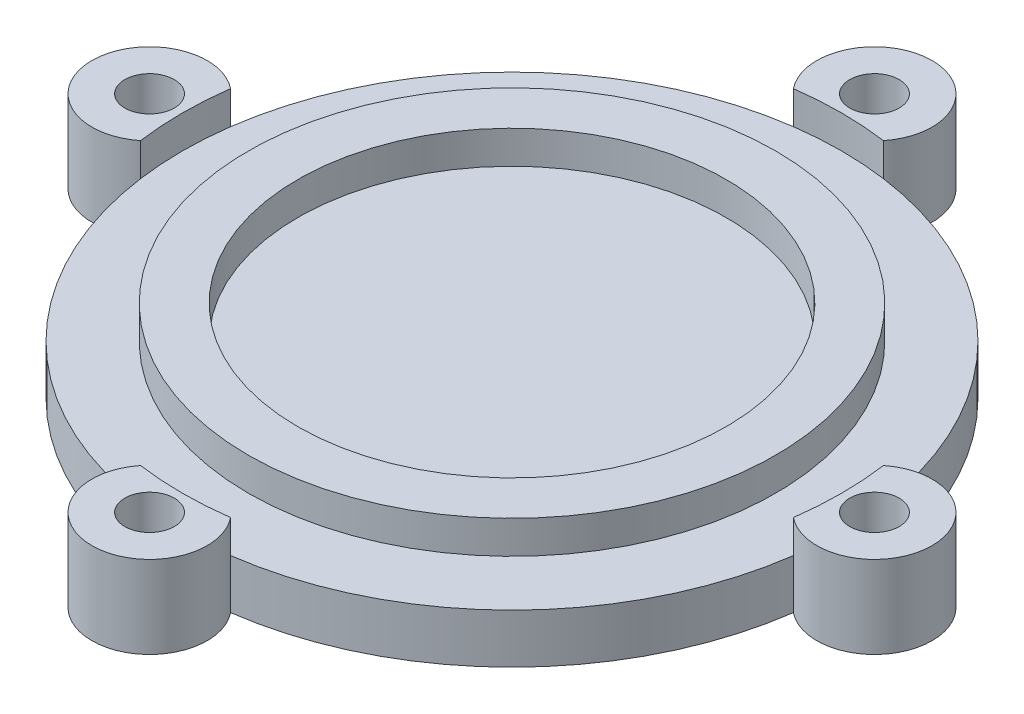
ISO-10303-21;
HEADER;
FILE_DESCRIPTION(('STEP AP214'),'2;1');
FILE_NAME('part.step','',(''),(''),'','','');
FILE_SCHEMA(('AUTOMOTIVE_DESIGN { 1 0 10303 214 1 1 1 1 }'));
ENDSEC;
DATA;
#1=APPLICATION_CONTEXT('core data for automotive mechanical design processes');
#2=APPLICATION_PROTOCOL_DEFINITION('international standard','automotive_design',2000,#1);
#3=PRODUCT_CONTEXT('',#1,'mechanical');
#4=PRODUCT('Part','Part','',(#3));
#5=PRODUCT_RELATED_PRODUCT_CATEGORY('part','',(#4));
#6=PRODUCT_DEFINITION_FORMATION('','',#4);
#7=PRODUCT_DEFINITION_CONTEXT('part definition',#1,'design');
#8=PRODUCT_DEFINITION('design','',#6,#7);
#9=PRODUCT_DEFINITION_SHAPE('','',#8);
#10=(LENGTH_UNIT() NAMED_UNIT(*) SI_UNIT(.MILLI.,.METRE.));
#11=(NAMED_UNIT(*) PLANE_ANGLE_UNIT() SI_UNIT($,.RADIAN.));
#12=(NAMED_UNIT(*) SI_UNIT($,.STERADIAN.) SOLID_ANGLE_UNIT());
#13=UNCERTAINTY_MEASURE_WITH_UNIT(LENGTH_MEASURE(1.E-05),#10,'distance_accuracy_value','');
#14=(GEOMETRIC_REPRESENTATION_CONTEXT(3) GLOBAL_UNCERTAINTY_ASSIGNED_CONTEXT((#13)) GLOBAL_UNIT_ASSIGNED_CONTEXT((#10,
#11,#12)) REPRESENTATION_CONTEXT('',''));
#15=CARTESIAN_POINT('',(0.,0.,0.));
#16=DIRECTION('',(0.,0.,1.));
#17=DIRECTION('',(1.,0.,0.));
#18=AXIS2_PLACEMENT_3D('',#15,#16,#17);
#19=CARTESIAN_POINT('',(0.,3.,0.));
#20=DIRECTION('',(0.,1.,0.));
#21=DIRECTION('',(0.,0.,1.));
#22=AXIS2_PLACEMENT_3D('',#19,#20,#21);
#23=PLANE('',#22);
#24=CARTESIAN_POINT('',(0.,3.,0.));
#25=DIRECTION('',(0.,1.,0.));
#26=DIRECTION('',(0.,0.,1.));
#27=AXIS2_PLACEMENT_3D('',#24,#25,#26);
#28=CIRCLE('',#27,16.);
#29=CARTESIAN_POINT('',(0.,3.,16.));
#30=VERTEX_POINT('',#29);
#31=EDGE_CURVE('E390',#30,#30,#28,.T.);
#32=ORIENTED_EDGE('',*,*,#31,.F.);
#33=EDGE_LOOP('',(#32));
#34=FACE_BOUND('',#33,.T.);
#35=CARTESIAN_POINT('',(0.,3.,0.));
#36=DIRECTION('',(0.,1.,0.));
#37=DIRECTION('',(0.,0.,1.));
#38=AXIS2_PLACEMENT_3D('',#35,#36,#37);
#39=CIRCLE('',#38,20.);
#40=CARTESIAN_POINT('',(-19.8125,3.,-2.73218662429926));
#41=VERTEX_POINT('',#40);
#42=CARTESIAN_POINT('',(-19.8125,3.,2.73218662429921));
#43=VERTEX_POINT('',#42);
#44=EDGE_CURVE('E97',#41,#43,#39,.T.);
#45=ORIENTED_EDGE('',*,*,#44,.T.);
#46=CARTESIAN_POINT('',(0.,3.,0.));
#47=DIRECTION('',(0.,1.,0.));
#48=DIRECTION('',(0.,0.,1.));
#49=AXIS2_PLACEMENT_3D('',#46,#47,#48);
#50=CIRCLE('',#49,20.);
#51=CARTESIAN_POINT('',(-2.73218662429929,3.,19.8125));
#52=VERTEX_POINT('',#51);
#53=EDGE_CURVE('E251',#43,#52,#50,.T.);
#54=ORIENTED_EDGE('',*,*,#53,.T.);
#55=CARTESIAN_POINT('',(0.,3.,0.));
#56=DIRECTION('',(0.,1.,0.));
#57=DIRECTION('',(0.,0.,1.));
#58=AXIS2_PLACEMENT_3D('',#55,#56,#57);
#59=CIRCLE('',#58,20.);
#60=CARTESIAN_POINT('',(2.73218662429922,3.,19.8125));
#61=VERTEX_POINT('',#60);
#62=EDGE_CURVE('E236',#52,#61,#59,.T.);
#63=ORIENTED_EDGE('',*,*,#62,.T.);
#64=CARTESIAN_POINT('',(19.8125,3.,2.73218662429931));
#65=VERTEX_POINT('',#64);
#66=EDGE_CURVE('E246',#61,#65,#50,.T.);
#67=ORIENTED_EDGE('',*,*,#66,.T.);
#68=CARTESIAN_POINT('',(0.,3.,0.));
#69=DIRECTION('',(0.,1.,0.));
#70=DIRECTION('',(0.,0.,1.));
#71=AXIS2_PLACEMENT_3D('',#68,#69,#70);
#72=CIRCLE('',#71,20.);
#73=CARTESIAN_POINT('',(19.8125,3.,-2.73218662429928));
#74=VERTEX_POINT('',#73);
#75=EDGE_CURVE('E220',#65,#74,#72,.T.);
#76=ORIENTED_EDGE('',*,*,#75,.T.);
#77=CARTESIAN_POINT('',(2.73218662429928,3.,-19.8125));
#78=VERTEX_POINT('',#77);
#79=EDGE_CURVE('E249',#74,#78,#50,.T.);
#80=ORIENTED_EDGE('',*,*,#79,.T.);
#81=CARTESIAN_POINT('',(0.,3.,0.));
#82=DIRECTION('',(0.,1.,0.));
#83=DIRECTION('',(0.,0.,1.));
#84=AXIS2_PLACEMENT_3D('',#81,#82,#83);
#85=CIRCLE('',#84,20.);
#86=CARTESIAN_POINT('',(-2.73218662429926,3.,-19.8125));
#87=VERTEX_POINT('',#86);
#88=EDGE_CURVE('E204',#78,#87,#85,.T.);
#89=ORIENTED_EDGE('',*,*,#88,.T.);
#90=EDGE_CURVE('E407',#87,#41,#50,.T.);
#91=ORIENTED_EDGE('',*,*,#90,.T.);
#92=EDGE_LOOP('',(#45,#54,#63,#67,#76,#80,#89,#91));
#93=FACE_BOUND('',#92,.T.);
#94=ADVANCED_FACE('F80',(#34,#93),#23,.T.);
#95=CARTESIAN_POINT('',(0.,3.,22.));
#96=DIRECTION('',(0.,-1.,0.));
#97=DIRECTION('',(0.,0.,-1.));
#98=AXIS2_PLACEMENT_3D('',#95,#96,#97);
#99=CYLINDRICAL_SURFACE('',#98,3.49999999999997);
#100=CARTESIAN_POINT('',(0.,0.,22.));
#101=DIRECTION('',(0.,1.,0.));
#102=DIRECTION('',(0.,0.,1.));
#103=AXIS2_PLACEMENT_3D('',#100,#101,#102);
#104=CIRCLE('',#103,3.49999999999997);
#105=CARTESIAN_POINT('',(2.73218662429922,0.,19.8125));
#106=VERTEX_POINT('',#105);
#107=CARTESIAN_POINT('',(-2.73218662429927,0.,19.8125));
#108=VERTEX_POINT('',#107);
#109=EDGE_CURVE('E254',#106,#108,#104,.F.);
#110=ORIENTED_EDGE('',*,*,#109,.F.);
#111=DIRECTION('',(0.,-1.,0.));
#112=VECTOR('',#111,1.);
#113=CARTESIAN_POINT('',(2.73218662429922,3.,19.8125));
#114=LINE('',#113,#112);
#115=EDGE_CURVE('E89',#61,#106,#114,.T.);
#116=ORIENTED_EDGE('',*,*,#115,.F.);
#117=DIRECTION('',(0.,-1.,0.));
#118=VECTOR('',#117,1.);
#119=CARTESIAN_POINT('',(2.73218662429925,5.,19.8125));
#120=LINE('',#119,#118);
#121=CARTESIAN_POINT('',(2.73218662429925,5.,19.8125));
#122=VERTEX_POINT('',#121);
#123=EDGE_CURVE('E143',#122,#61,#120,.T.);
#124=ORIENTED_EDGE('',*,*,#123,.F.);
#125=CARTESIAN_POINT('',(0.,5.,22.));
#126=DIRECTION('',(0.,1.,0.));
#127=DIRECTION('',(0.,0.,1.));
#128=AXIS2_PLACEMENT_3D('',#125,#126,#127);
#129=CIRCLE('',#128,3.49999999999997);
#130=CARTESIAN_POINT('',(-2.73218662429929,5.,19.8125));
#131=VERTEX_POINT('',#130);
#132=EDGE_CURVE('E237',#131,#122,#129,.T.);
#133=ORIENTED_EDGE('',*,*,#132,.F.);
#134=DIRECTION('',(0.,-1.,0.));
#135=VECTOR('',#134,1.);
#136=CARTESIAN_POINT('',(-2.73218662429929,5.,19.8125));
#137=LINE('',#136,#135);
#138=EDGE_CURVE('E241',#131,#52,#137,.T.);
#139=ORIENTED_EDGE('',*,*,#138,.T.);
#140=DIRECTION('',(0.,-1.,0.));
#141=VECTOR('',#140,1.);
#142=CARTESIAN_POINT('',(-2.73218662429927,3.,19.8125));
#143=LINE('',#142,#141);
#144=EDGE_CURVE('E136',#52,#108,#143,.T.);
#145=ORIENTED_EDGE('',*,*,#144,.T.);
#146=EDGE_LOOP('',(#110,#116,#124,#133,#139,#145));
#147=FACE_BOUND('',#146,.T.);
#148=ADVANCED_FACE('F302',(#147),#99,.T.);
#149=CARTESIAN_POINT('',(0.,3.,0.));
#150=DIRECTION('',(0.,-1.,0.));
#151=DIRECTION('',(0.,0.,-1.));
#152=AXIS2_PLACEMENT_3D('',#149,#150,#151);
#153=CYLINDRICAL_SURFACE('',#152,20.);
#154=CARTESIAN_POINT('',(0.,0.,0.));
#155=DIRECTION('',(0.,1.,0.));
#156=DIRECTION('',(0.,0.,1.));
#157=AXIS2_PLACEMENT_3D('',#154,#155,#156);
#158=CIRCLE('',#157,20.);
#159=CARTESIAN_POINT('',(19.8125,0.,2.73218662429931));
#160=VERTEX_POINT('',#159);
#161=EDGE_CURVE('E257',#106,#160,#158,.T.);
#162=ORIENTED_EDGE('',*,*,#161,.T.);
#163=DIRECTION('',(0.,-1.,0.));
#164=VECTOR('',#163,1.);
#165=CARTESIAN_POINT('',(19.8125,3.,2.73218662429931));
#166=LINE('',#165,#164);
#167=EDGE_CURVE('E290',#65,#160,#166,.T.);
#168=ORIENTED_EDGE('',*,*,#167,.F.);
#169=ORIENTED_EDGE('',*,*,#66,.F.);
#170=ORIENTED_EDGE('',*,*,#115,.T.);
#171=EDGE_LOOP('',(#162,#168,#169,#170));
#172=FACE_BOUND('',#171,.T.);
#173=ADVANCED_FACE('F295',(#172),#153,.T.);
#174=CARTESIAN_POINT('',(22.,3.,0.));
#175=DIRECTION('',(0.,-1.,0.));
#176=DIRECTION('',(0.,0.,-1.));
#177=AXIS2_PLACEMENT_3D('',#174,#175,#176);
#178=CYLINDRICAL_SURFACE('',#177,3.49999999999999);
#179=CARTESIAN_POINT('',(22.,0.,0.));
#180=DIRECTION('',(0.,1.,0.));
#181=DIRECTION('',(0.,0.,1.));
#182=AXIS2_PLACEMENT_3D('',#179,#180,#181);
#183=CIRCLE('',#182,3.49999999999999);
#184=CARTESIAN_POINT('',(19.8125,0.,-2.73218662429928));
#185=VERTEX_POINT('',#184);
#186=EDGE_CURVE('E260',#185,#160,#183,.F.);
#187=ORIENTED_EDGE('',*,*,#186,.F.);
#188=DIRECTION('',(0.,-1.,0.));
#189=VECTOR('',#188,1.);
#190=CARTESIAN_POINT('',(19.8125,3.,-2.73218662429928));
#191=LINE('',#190,#189);
#192=EDGE_CURVE('E288',#74,#185,#191,.T.);
#193=ORIENTED_EDGE('',*,*,#192,.F.);
#194=DIRECTION('',(0.,-1.,0.));
#195=VECTOR('',#194,1.);
#196=CARTESIAN_POINT('',(19.8125,5.,-2.73218662429928));
#197=LINE('',#196,#195);
#198=CARTESIAN_POINT('',(19.8125,5.,-2.73218662429928));
#199=VERTEX_POINT('',#198);
#200=EDGE_CURVE('E231',#199,#74,#197,.T.);
#201=ORIENTED_EDGE('',*,*,#200,.F.);
#202=CARTESIAN_POINT('',(22.,5.,0.));
#203=DIRECTION('',(0.,1.,0.));
#204=DIRECTION('',(0.,0.,1.));
#205=AXIS2_PLACEMENT_3D('',#202,#203,#204);
#206=CIRCLE('',#205,3.49999999999999);
#207=CARTESIAN_POINT('',(19.8125,5.,2.7321866242993));
#208=VERTEX_POINT('',#207);
#209=EDGE_CURVE('E221',#208,#199,#206,.T.);
#210=ORIENTED_EDGE('',*,*,#209,.F.);
#211=DIRECTION('',(0.,-1.,0.));
#212=VECTOR('',#211,1.);
#213=CARTESIAN_POINT('',(19.8125,5.,2.7321866242993));
#214=LINE('',#213,#212);
#215=EDGE_CURVE('E226',#208,#65,#214,.T.);
#216=ORIENTED_EDGE('',*,*,#215,.T.);
#217=ORIENTED_EDGE('',*,*,#167,.T.);
#218=EDGE_LOOP('',(#187,#193,#201,#210,#216,#217));
#219=FACE_BOUND('',#218,.T.);
#220=ADVANCED_FACE('F308',(#219),#178,.T.);
#221=CARTESIAN_POINT('',(2.73218662429928,0.,-19.8125));
#222=VERTEX_POINT('',#221);
#223=EDGE_CURVE('E262',#185,#222,#158,.T.);
#224=ORIENTED_EDGE('',*,*,#223,.T.);
#225=DIRECTION('',(0.,-1.,0.));
#226=VECTOR('',#225,1.);
#227=CARTESIAN_POINT('',(2.73218662429928,3.,-19.8125));
#228=LINE('',#227,#226);
#229=EDGE_CURVE('E286',#78,#222,#228,.T.);
#230=ORIENTED_EDGE('',*,*,#229,.F.);
#231=ORIENTED_EDGE('',*,*,#79,.F.);
#232=ORIENTED_EDGE('',*,*,#192,.T.);
#233=EDGE_LOOP('',(#224,#230,#231,#232));
#234=FACE_BOUND('',#233,.T.);
#235=ADVANCED_FACE('F310',(#234),#153,.T.);
#236=CARTESIAN_POINT('',(0.,3.,-22.));
#237=DIRECTION('',(0.,-1.,0.));
#238=DIRECTION('',(0.,0.,-1.));
#239=AXIS2_PLACEMENT_3D('',#236,#237,#238);
#240=CYLINDRICAL_SURFACE('',#239,3.49999999999997);
#241=CARTESIAN_POINT('',(0.,0.,-22.));
#242=DIRECTION('',(0.,1.,0.));
#243=DIRECTION('',(0.,0.,1.));
#244=AXIS2_PLACEMENT_3D('',#241,#242,#243);
#245=CIRCLE('',#244,3.49999999999997);
#246=CARTESIAN_POINT('',(-2.73218662429928,0.,-19.8125));
#247=VERTEX_POINT('',#246);
#248=EDGE_CURVE('E265',#247,#222,#245,.F.);
#249=ORIENTED_EDGE('',*,*,#248,.F.);
#250=DIRECTION('',(0.,-1.,0.));
#251=VECTOR('',#250,1.);
#252=CARTESIAN_POINT('',(-2.73218662429928,3.,-19.8125));
#253=LINE('',#252,#251);
#254=EDGE_CURVE('E284',#87,#247,#253,.T.);
#255=ORIENTED_EDGE('',*,*,#254,.F.);
#256=DIRECTION('',(0.,-1.,0.));
#257=VECTOR('',#256,1.);
#258=CARTESIAN_POINT('',(-2.73218662429926,5.,-19.8125));
#259=LINE('',#258,#257);
#260=CARTESIAN_POINT('',(-2.73218662429926,5.,-19.8125));
#261=VERTEX_POINT('',#260);
#262=EDGE_CURVE('E215',#261,#87,#259,.T.);
#263=ORIENTED_EDGE('',*,*,#262,.F.);
#264=CARTESIAN_POINT('',(0.,5.,-22.));
#265=DIRECTION('',(0.,1.,0.));
#266=DIRECTION('',(0.,0.,1.));
#267=AXIS2_PLACEMENT_3D('',#264,#265,#266);
#268=CIRCLE('',#267,3.49999999999997);
#269=CARTESIAN_POINT('',(2.73218662429927,5.,-19.8125));
#270=VERTEX_POINT('',#269);
#271=EDGE_CURVE('E205',#270,#261,#268,.T.);
#272=ORIENTED_EDGE('',*,*,#271,.F.);
#273=DIRECTION('',(0.,-1.,0.));
#274=VECTOR('',#273,1.);
#275=CARTESIAN_POINT('',(2.73218662429927,5.,-19.8125));
#276=LINE('',#275,#274);
#277=EDGE_CURVE('E210',#270,#78,#276,.T.);
#278=ORIENTED_EDGE('',*,*,#277,.T.);
#279=ORIENTED_EDGE('',*,*,#229,.T.);
#280=EDGE_LOOP('',(#249,#255,#263,#272,#278,#279));
#281=FACE_BOUND('',#280,.T.);
#282=ADVANCED_FACE('F319',(#281),#240,.T.);
#283=CARTESIAN_POINT('',(-19.8125,0.,-2.73218662429926));
#284=VERTEX_POINT('',#283);
#285=EDGE_CURVE('E268',#247,#284,#158,.T.);
#286=ORIENTED_EDGE('',*,*,#285,.T.);
#287=DIRECTION('',(0.,-1.,0.));
#288=VECTOR('',#287,1.);
#289=CARTESIAN_POINT('',(-19.8125,3.,-2.73218662429926));
#290=LINE('',#289,#288);
#291=EDGE_CURVE('E282',#41,#284,#290,.T.);
#292=ORIENTED_EDGE('',*,*,#291,.F.);
#293=ORIENTED_EDGE('',*,*,#90,.F.);
#294=ORIENTED_EDGE('',*,*,#254,.T.);
#295=EDGE_LOOP('',(#286,#292,#293,#294));
#296=FACE_BOUND('',#295,.T.);
#297=ADVANCED_FACE('F322',(#296),#153,.T.);
#298=CARTESIAN_POINT('',(-22.,3.,0.));
#299=DIRECTION('',(0.,-1.,0.));
#300=DIRECTION('',(0.,0.,-1.));
#301=AXIS2_PLACEMENT_3D('',#298,#299,#300);
#302=CYLINDRICAL_SURFACE('',#301,3.49999999999997);
#303=CARTESIAN_POINT('',(-22.,0.,0.));
#304=DIRECTION('',(0.,1.,0.));
#305=DIRECTION('',(0.,0.,1.));
#306=AXIS2_PLACEMENT_3D('',#303,#304,#305);
#307=CIRCLE('',#306,3.49999999999997);
#308=CARTESIAN_POINT('',(-19.8125,0.,2.73218662429923));
#309=VERTEX_POINT('',#308);
#310=EDGE_CURVE('E269',#309,#284,#307,.F.);
#311=ORIENTED_EDGE('',*,*,#310,.F.);
#312=DIRECTION('',(0.,-1.,0.));
#313=VECTOR('',#312,1.);
#314=CARTESIAN_POINT('',(-19.8125,3.,2.73218662429923));
#315=LINE('',#314,#313);
#316=EDGE_CURVE('E128',#43,#309,#315,.T.);
#317=ORIENTED_EDGE('',*,*,#316,.F.);
#318=DIRECTION('',(0.,-1.,0.));
#319=VECTOR('',#318,1.);
#320=CARTESIAN_POINT('',(-19.8125,5.,2.73218662429921));
#321=LINE('',#320,#319);
#322=CARTESIAN_POINT('',(-19.8125,5.,2.73218662429921));
#323=VERTEX_POINT('',#322);
#324=EDGE_CURVE('E189',#323,#43,#321,.T.);
#325=ORIENTED_EDGE('',*,*,#324,.F.);
#326=CARTESIAN_POINT('',(-22.,5.,0.));
#327=DIRECTION('',(0.,1.,0.));
#328=DIRECTION('',(0.,0.,1.));
#329=AXIS2_PLACEMENT_3D('',#326,#327,#328);
#330=CIRCLE('',#329,3.49999999999997);
#331=CARTESIAN_POINT('',(-19.8125,5.,-2.73218662429925));
#332=VERTEX_POINT('',#331);
#333=EDGE_CURVE('E181',#332,#323,#330,.T.);
#334=ORIENTED_EDGE('',*,*,#333,.F.);
#335=DIRECTION('',(0.,-1.,0.));
#336=VECTOR('',#335,1.);
#337=CARTESIAN_POINT('',(-19.8125,5.,-2.73218662429925));
#338=LINE('',#337,#336);
#339=EDGE_CURVE('E193',#332,#41,#338,.T.);
#340=ORIENTED_EDGE('',*,*,#339,.T.);
#341=ORIENTED_EDGE('',*,*,#291,.T.);
#342=EDGE_LOOP('',(#311,#317,#325,#334,#340,#341));
#343=FACE_BOUND('',#342,.T.);
#344=ADVANCED_FACE('F191',(#343),#302,.T.);
#345=CARTESIAN_POINT('',(0.,3.,-22.));
#346=DIRECTION('',(0.,-1.,0.));
#347=DIRECTION('',(0.,0.,-1.));
#348=AXIS2_PLACEMENT_3D('',#345,#346,#347);
#349=CYLINDRICAL_SURFACE('',#348,1.5);
#350=CARTESIAN_POINT('',(0.,0.,-22.));
#351=DIRECTION('',(0.,1.,0.));
#352=DIRECTION('',(0.,0.,1.));
#353=AXIS2_PLACEMENT_3D('',#350,#351,#352);
#354=CIRCLE('',#353,1.5);
#355=CARTESIAN_POINT('',(0.,0.,-20.5));
#356=VERTEX_POINT('',#355);
#357=EDGE_CURVE('E275',#356,#356,#354,.T.);
#358=ORIENTED_EDGE('',*,*,#357,.F.);
#359=EDGE_LOOP('',(#358));
#360=FACE_BOUND('',#359,.T.);
#361=CARTESIAN_POINT('',(0.,5.,-22.));
#362=DIRECTION('',(0.,1.,0.));
#363=DIRECTION('',(0.,0.,1.));
#364=AXIS2_PLACEMENT_3D('',#361,#362,#363);
#365=CIRCLE('',#364,1.5);
#366=CARTESIAN_POINT('',(0.,5.,-20.5));
#367=VERTEX_POINT('',#366);
#368=EDGE_CURVE('E192',#367,#367,#365,.T.);
#369=ORIENTED_EDGE('',*,*,#368,.T.);
#370=EDGE_LOOP('',(#369));
#371=FACE_BOUND('',#370,.T.);
#372=ADVANCED_FACE('F325',(#360,#371),#349,.F.);
#373=CARTESIAN_POINT('',(-22.,3.,0.));
#374=DIRECTION('',(0.,-1.,0.));
#375=DIRECTION('',(0.,0.,-1.));
#376=AXIS2_PLACEMENT_3D('',#373,#374,#375);
#377=CYLINDRICAL_SURFACE('',#376,1.49999999999997);
#378=CARTESIAN_POINT('',(-22.,0.,0.));
#379=DIRECTION('',(0.,1.,0.));
#380=DIRECTION('',(0.,0.,1.));
#381=AXIS2_PLACEMENT_3D('',#378,#379,#380);
#382=CIRCLE('',#381,1.49999999999997);
#383=CARTESIAN_POINT('',(-22.,0.,1.49999999999995));
#384=VERTEX_POINT('',#383);
#385=EDGE_CURVE('E272',#384,#384,#382,.T.);
#386=ORIENTED_EDGE('',*,*,#385,.F.);
#387=EDGE_LOOP('',(#386));
#388=FACE_BOUND('',#387,.T.);
#389=CARTESIAN_POINT('',(-22.,5.,0.));
#390=DIRECTION('',(0.,1.,0.));
#391=DIRECTION('',(0.,0.,1.));
#392=AXIS2_PLACEMENT_3D('',#389,#390,#391);
#393=CIRCLE('',#392,1.49999999999997);
#394=CARTESIAN_POINT('',(-22.,5.,1.49999999999995));
#395=VERTEX_POINT('',#394);
#396=EDGE_CURVE('E200',#395,#395,#393,.T.);
#397=ORIENTED_EDGE('',*,*,#396,.T.);
#398=EDGE_LOOP('',(#397));
#399=FACE_BOUND('',#398,.T.);
#400=ADVANCED_FACE('F328',(#388,#399),#377,.F.);
#401=EDGE_CURVE('E261',#309,#108,#158,.T.);
#402=ORIENTED_EDGE('',*,*,#401,.T.);
#403=ORIENTED_EDGE('',*,*,#144,.F.);
#404=ORIENTED_EDGE('',*,*,#53,.F.);
#405=ORIENTED_EDGE('',*,*,#316,.T.);
#406=EDGE_LOOP('',(#402,#403,#404,#405));
#407=FACE_BOUND('',#406,.T.);
#408=ADVANCED_FACE('F311',(#407),#153,.T.);
#409=CARTESIAN_POINT('',(0.,3.,22.));
#410=DIRECTION('',(0.,-1.,0.));
#411=DIRECTION('',(0.,0.,-1.));
#412=AXIS2_PLACEMENT_3D('',#409,#410,#411);
#413=CYLINDRICAL_SURFACE('',#412,1.5);
#414=CARTESIAN_POINT('',(0.,0.,22.));
#415=DIRECTION('',(0.,1.,0.));
#416=DIRECTION('',(0.,0.,1.));
#417=AXIS2_PLACEMENT_3D('',#414,#415,#416);
#418=CIRCLE('',#417,1.5);
#419=CARTESIAN_POINT('',(0.,0.,23.5));
#420=VERTEX_POINT('',#419);
#421=EDGE_CURVE('E245',#420,#420,#418,.T.);
#422=ORIENTED_EDGE('',*,*,#421,.F.);
#423=EDGE_LOOP('',(#422));
#424=FACE_BOUND('',#423,.T.);
#425=CARTESIAN_POINT('',(0.,5.,22.));
#426=DIRECTION('',(0.,1.,0.));
#427=DIRECTION('',(0.,0.,1.));
#428=AXIS2_PLACEMENT_3D('',#425,#426,#427);
#429=CIRCLE('',#428,1.5);
#430=CARTESIAN_POINT('',(0.,5.,23.5));
#431=VERTEX_POINT('',#430);
#432=EDGE_CURVE('E233',#431,#431,#429,.T.);
#433=ORIENTED_EDGE('',*,*,#432,.T.);
#434=EDGE_LOOP('',(#433));
#435=FACE_BOUND('',#434,.T.);
#436=ADVANCED_FACE('F82',(#424,#435),#413,.F.);
#437=CARTESIAN_POINT('',(22.,3.,0.));
#438=DIRECTION('',(0.,-1.,0.));
#439=DIRECTION('',(0.,0.,-1.));
#440=AXIS2_PLACEMENT_3D('',#437,#438,#439);
#441=CYLINDRICAL_SURFACE('',#440,1.5);
#442=CARTESIAN_POINT('',(22.,0.,0.));
#443=DIRECTION('',(0.,1.,0.));
#444=DIRECTION('',(0.,0.,1.));
#445=AXIS2_PLACEMENT_3D('',#442,#443,#444);
#446=CIRCLE('',#445,1.5);
#447=CARTESIAN_POINT('',(22.,0.,1.50000000000001));
#448=VERTEX_POINT('',#447);
#449=EDGE_CURVE('E250',#448,#448,#446,.T.);
#450=ORIENTED_EDGE('',*,*,#449,.F.);
#451=EDGE_LOOP('',(#450));
#452=FACE_BOUND('',#451,.T.);
#453=CARTESIAN_POINT('',(22.,5.,0.));
#454=DIRECTION('',(0.,1.,0.));
#455=DIRECTION('',(0.,0.,1.));
#456=AXIS2_PLACEMENT_3D('',#453,#454,#455);
#457=CIRCLE('',#456,1.5);
#458=CARTESIAN_POINT('',(22.,5.,1.50000000000001));
#459=VERTEX_POINT('',#458);
#460=EDGE_CURVE('E217',#459,#459,#457,.T.);
#461=ORIENTED_EDGE('',*,*,#460,.T.);
#462=EDGE_LOOP('',(#461));
#463=FACE_BOUND('',#462,.T.);
#464=ADVANCED_FACE('F335',(#452,#463),#441,.F.);
#465=CARTESIAN_POINT('',(0.,0.,0.));
#466=DIRECTION('',(0.,1.,0.));
#467=DIRECTION('',(0.,0.,1.));
#468=AXIS2_PLACEMENT_3D('',#465,#466,#467);
#469=PLANE('',#468);
#470=ORIENTED_EDGE('',*,*,#421,.T.);
#471=EDGE_LOOP('',(#470));
#472=FACE_BOUND('',#471,.T.);
#473=ORIENTED_EDGE('',*,*,#109,.T.);
#474=ORIENTED_EDGE('',*,*,#401,.F.);
#475=ORIENTED_EDGE('',*,*,#310,.T.);
#476=ORIENTED_EDGE('',*,*,#285,.F.);
#477=ORIENTED_EDGE('',*,*,#248,.T.);
#478=ORIENTED_EDGE('',*,*,#223,.F.);
#479=ORIENTED_EDGE('',*,*,#186,.T.);
#480=ORIENTED_EDGE('',*,*,#161,.F.);
#481=EDGE_LOOP('',(#473,#474,#475,#476,#477,#478,#479,#480));
#482=FACE_BOUND('',#481,.T.);
#483=ORIENTED_EDGE('',*,*,#385,.T.);
#484=EDGE_LOOP('',(#483));
#485=FACE_BOUND('',#484,.T.);
#486=ORIENTED_EDGE('',*,*,#357,.T.);
#487=EDGE_LOOP('',(#486));
#488=FACE_BOUND('',#487,.T.);
#489=ORIENTED_EDGE('',*,*,#449,.T.);
#490=EDGE_LOOP('',(#489));
#491=FACE_BOUND('',#490,.T.);
#492=ADVANCED_FACE('F298',(#472,#482,#485,#488,#491),#469,.F.);
#493=CARTESIAN_POINT('',(0.,5.,11.));
#494=DIRECTION('',(0.,1.,0.));
#495=DIRECTION('',(0.,0.,1.));
#496=AXIS2_PLACEMENT_3D('',#493,#494,#495);
#497=PLANE('',#496);
#498=ORIENTED_EDGE('',*,*,#132,.T.);
#499=CARTESIAN_POINT('',(0.,5.,0.));
#500=DIRECTION('',(0.,1.,0.));
#501=DIRECTION('',(0.,0.,1.));
#502=AXIS2_PLACEMENT_3D('',#499,#500,#501);
#503=CIRCLE('',#502,20.);
#504=EDGE_CURVE('E239',#131,#122,#503,.T.);
#505=ORIENTED_EDGE('',*,*,#504,.F.);
#506=EDGE_LOOP('',(#498,#505));
#507=FACE_BOUND('',#506,.T.);
#508=ORIENTED_EDGE('',*,*,#432,.F.);
#509=EDGE_LOOP('',(#508));
#510=FACE_BOUND('',#509,.T.);
#511=ADVANCED_FACE('F340',(#507,#510),#497,.T.);
#512=CARTESIAN_POINT('',(0.,5.,0.));
#513=DIRECTION('',(0.,-1.,0.));
#514=DIRECTION('',(0.,0.,-1.));
#515=AXIS2_PLACEMENT_3D('',#512,#513,#514);
#516=CYLINDRICAL_SURFACE('',#515,20.);
#517=ORIENTED_EDGE('',*,*,#62,.F.);
#518=ORIENTED_EDGE('',*,*,#138,.F.);
#519=ORIENTED_EDGE('',*,*,#504,.T.);
#520=ORIENTED_EDGE('',*,*,#123,.T.);
#521=EDGE_LOOP('',(#517,#518,#519,#520));
#522=FACE_BOUND('',#521,.T.);
#523=ADVANCED_FACE('F343',(#522),#516,.F.);
#524=CARTESIAN_POINT('',(11.,5.,0.));
#525=DIRECTION('',(0.,1.,0.));
#526=DIRECTION('',(0.,0.,1.));
#527=AXIS2_PLACEMENT_3D('',#524,#525,#526);
#528=PLANE('',#527);
#529=ORIENTED_EDGE('',*,*,#209,.T.);
#530=CARTESIAN_POINT('',(0.,5.,0.));
#531=DIRECTION('',(0.,1.,0.));
#532=DIRECTION('',(0.,0.,1.));
#533=AXIS2_PLACEMENT_3D('',#530,#531,#532);
#534=CIRCLE('',#533,20.);
#535=EDGE_CURVE('E223',#208,#199,#534,.T.);
#536=ORIENTED_EDGE('',*,*,#535,.F.);
#537=EDGE_LOOP('',(#529,#536));
#538=FACE_BOUND('',#537,.T.);
#539=ORIENTED_EDGE('',*,*,#460,.F.);
#540=EDGE_LOOP('',(#539));
#541=FACE_BOUND('',#540,.T.);
#542=ADVANCED_FACE('F346',(#538,#541),#528,.T.);
#543=CARTESIAN_POINT('',(0.,5.,0.));
#544=DIRECTION('',(0.,-1.,0.));
#545=DIRECTION('',(0.,0.,-1.));
#546=AXIS2_PLACEMENT_3D('',#543,#544,#545);
#547=CYLINDRICAL_SURFACE('',#546,20.);
#548=ORIENTED_EDGE('',*,*,#75,.F.);
#549=ORIENTED_EDGE('',*,*,#215,.F.);
#550=ORIENTED_EDGE('',*,*,#535,.T.);
#551=ORIENTED_EDGE('',*,*,#200,.T.);
#552=EDGE_LOOP('',(#548,#549,#550,#551));
#553=FACE_BOUND('',#552,.T.);
#554=ADVANCED_FACE('F350',(#553),#547,.F.);
#555=CARTESIAN_POINT('',(0.,5.,-11.));
#556=DIRECTION('',(0.,1.,0.));
#557=DIRECTION('',(0.,0.,1.));
#558=AXIS2_PLACEMENT_3D('',#555,#556,#557);
#559=PLANE('',#558);
#560=ORIENTED_EDGE('',*,*,#271,.T.);
#561=CARTESIAN_POINT('',(0.,5.,0.));
#562=DIRECTION('',(0.,1.,0.));
#563=DIRECTION('',(0.,0.,1.));
#564=AXIS2_PLACEMENT_3D('',#561,#562,#563);
#565=CIRCLE('',#564,20.);
#566=EDGE_CURVE('E207',#270,#261,#565,.T.);
#567=ORIENTED_EDGE('',*,*,#566,.F.);
#568=EDGE_LOOP('',(#560,#567));
#569=FACE_BOUND('',#568,.T.);
#570=ORIENTED_EDGE('',*,*,#368,.F.);
#571=EDGE_LOOP('',(#570));
#572=FACE_BOUND('',#571,.T.);
#573=ADVANCED_FACE('F353',(#569,#572),#559,.T.);
#574=CARTESIAN_POINT('',(0.,5.,0.));
#575=DIRECTION('',(0.,-1.,0.));
#576=DIRECTION('',(0.,0.,-1.));
#577=AXIS2_PLACEMENT_3D('',#574,#575,#576);
#578=CYLINDRICAL_SURFACE('',#577,20.);
#579=ORIENTED_EDGE('',*,*,#88,.F.);
#580=ORIENTED_EDGE('',*,*,#277,.F.);
#581=ORIENTED_EDGE('',*,*,#566,.T.);
#582=ORIENTED_EDGE('',*,*,#262,.T.);
#583=EDGE_LOOP('',(#579,#580,#581,#582));
#584=FACE_BOUND('',#583,.T.);
#585=ADVANCED_FACE('F358',(#584),#578,.F.);
#586=CARTESIAN_POINT('',(-11.,5.,0.));
#587=DIRECTION('',(0.,1.,0.));
#588=DIRECTION('',(0.,0.,1.));
#589=AXIS2_PLACEMENT_3D('',#586,#587,#588);
#590=PLANE('',#589);
#591=ORIENTED_EDGE('',*,*,#333,.T.);
#592=CARTESIAN_POINT('',(0.,5.,0.));
#593=DIRECTION('',(0.,1.,0.));
#594=DIRECTION('',(0.,0.,1.));
#595=AXIS2_PLACEMENT_3D('',#592,#593,#594);
#596=CIRCLE('',#595,20.);
#597=EDGE_CURVE('E186',#332,#323,#596,.T.);
#598=ORIENTED_EDGE('',*,*,#597,.F.);
#599=EDGE_LOOP('',(#591,#598));
#600=FACE_BOUND('',#599,.T.);
#601=ORIENTED_EDGE('',*,*,#396,.F.);
#602=EDGE_LOOP('',(#601));
#603=FACE_BOUND('',#602,.T.);
#604=ADVANCED_FACE('F183',(#600,#603),#590,.T.);
#605=CARTESIAN_POINT('',(0.,5.,0.));
#606=DIRECTION('',(0.,-1.,0.));
#607=DIRECTION('',(0.,0.,-1.));
#608=AXIS2_PLACEMENT_3D('',#605,#606,#607);
#609=CYLINDRICAL_SURFACE('',#608,20.);
#610=ORIENTED_EDGE('',*,*,#44,.F.);
#611=ORIENTED_EDGE('',*,*,#339,.F.);
#612=ORIENTED_EDGE('',*,*,#597,.T.);
#613=ORIENTED_EDGE('',*,*,#324,.T.);
#614=EDGE_LOOP('',(#610,#611,#612,#613));
#615=FACE_BOUND('',#614,.T.);
#616=ADVANCED_FACE('F195',(#615),#609,.F.);
#617=CARTESIAN_POINT('',(0.,5.,0.));
#618=DIRECTION('',(0.,1.,0.));
#619=DIRECTION('',(0.,0.,1.));
#620=AXIS2_PLACEMENT_3D('',#617,#618,#619);
#621=PLANE('',#620);
#622=CARTESIAN_POINT('',(0.,5.,0.));
#623=DIRECTION('',(0.,1.,0.));
#624=DIRECTION('',(0.,0.,1.));
#625=AXIS2_PLACEMENT_3D('',#622,#623,#624);
#626=CIRCLE('',#625,16.);
#627=CARTESIAN_POINT('',(0.,5.,16.));
#628=VERTEX_POINT('',#627);
#629=EDGE_CURVE('E393',#628,#628,#626,.T.);
#630=ORIENTED_EDGE('',*,*,#629,.T.);
#631=EDGE_LOOP('',(#630));
#632=FACE_BOUND('',#631,.T.);
#633=CARTESIAN_POINT('',(0.,5.,0.));
#634=DIRECTION('',(0.,1.,0.));
#635=DIRECTION('',(0.,0.,1.));
#636=AXIS2_PLACEMENT_3D('',#633,#634,#635);
#637=CIRCLE('',#636,13.);
#638=CARTESIAN_POINT('',(0.,5.,13.));
#639=VERTEX_POINT('',#638);
#640=EDGE_CURVE('E387',#639,#639,#637,.T.);
#641=ORIENTED_EDGE('',*,*,#640,.F.);
#642=EDGE_LOOP('',(#641));
#643=FACE_BOUND('',#642,.T.);
#644=ADVANCED_FACE('F367',(#632,#643),#621,.T.);
#645=CARTESIAN_POINT('',(0.,5.,0.));
#646=DIRECTION('',(0.,-1.,0.));
#647=DIRECTION('',(0.,0.,-1.));
#648=AXIS2_PLACEMENT_3D('',#645,#646,#647);
#649=CYLINDRICAL_SURFACE('',#648,16.);
#650=ORIENTED_EDGE('',*,*,#629,.F.);
#651=EDGE_LOOP('',(#650));
#652=FACE_BOUND('',#651,.T.);
#653=ORIENTED_EDGE('',*,*,#31,.T.);
#654=EDGE_LOOP('',(#653));
#655=FACE_BOUND('',#654,.T.);
#656=ADVANCED_FACE('F370',(#652,#655),#649,.T.);
#657=CARTESIAN_POINT('',(0.,5.,0.));
#658=DIRECTION('',(0.,-1.,0.));
#659=DIRECTION('',(0.,0.,-1.));
#660=AXIS2_PLACEMENT_3D('',#657,#658,#659);
#661=CYLINDRICAL_SURFACE('',#660,13.);
#662=ORIENTED_EDGE('',*,*,#640,.T.);
#663=EDGE_LOOP('',(#662));
#664=FACE_BOUND('',#663,.T.);
#665=CARTESIAN_POINT('',(0.,3.,0.));
#666=DIRECTION('',(0.,1.,0.));
#667=DIRECTION('',(0.,0.,1.));
#668=AXIS2_PLACEMENT_3D('',#665,#666,#667);
#669=CIRCLE('',#668,13.);
#670=CARTESIAN_POINT('',(0.,3.,13.));
#671=VERTEX_POINT('',#670);
#672=EDGE_CURVE('E12',#671,#671,#669,.F.);
#673=ORIENTED_EDGE('',*,*,#672,.T.);
#674=EDGE_LOOP('',(#673));
#675=FACE_BOUND('',#674,.T.);
#676=ADVANCED_FACE('F373',(#664,#675),#661,.F.);
#677=ORIENTED_EDGE('',*,*,#672,.F.);
#678=EDGE_LOOP('',(#677));
#679=FACE_BOUND('',#678,.T.);
#680=ADVANCED_FACE('F314',(#679),#23,.T.);
#681=CLOSED_SHELL('',(#94,#148,#173,#220,#235,#282,#297,#344,#372,#400,#408,#436,#464,#492,#511,
#523,#542,#554,#573,#585,#604,#616,#644,#656,#676,#680));
#682=MANIFOLD_SOLID_BREP('B2',#681);
#683=ADVANCED_BREP_SHAPE_REPRESENTATION('',(#18,#682),#14);
#684=SHAPE_DEFINITION_REPRESENTATION(#9,#683);
ENDSEC;
END-ISO-10303-21;
